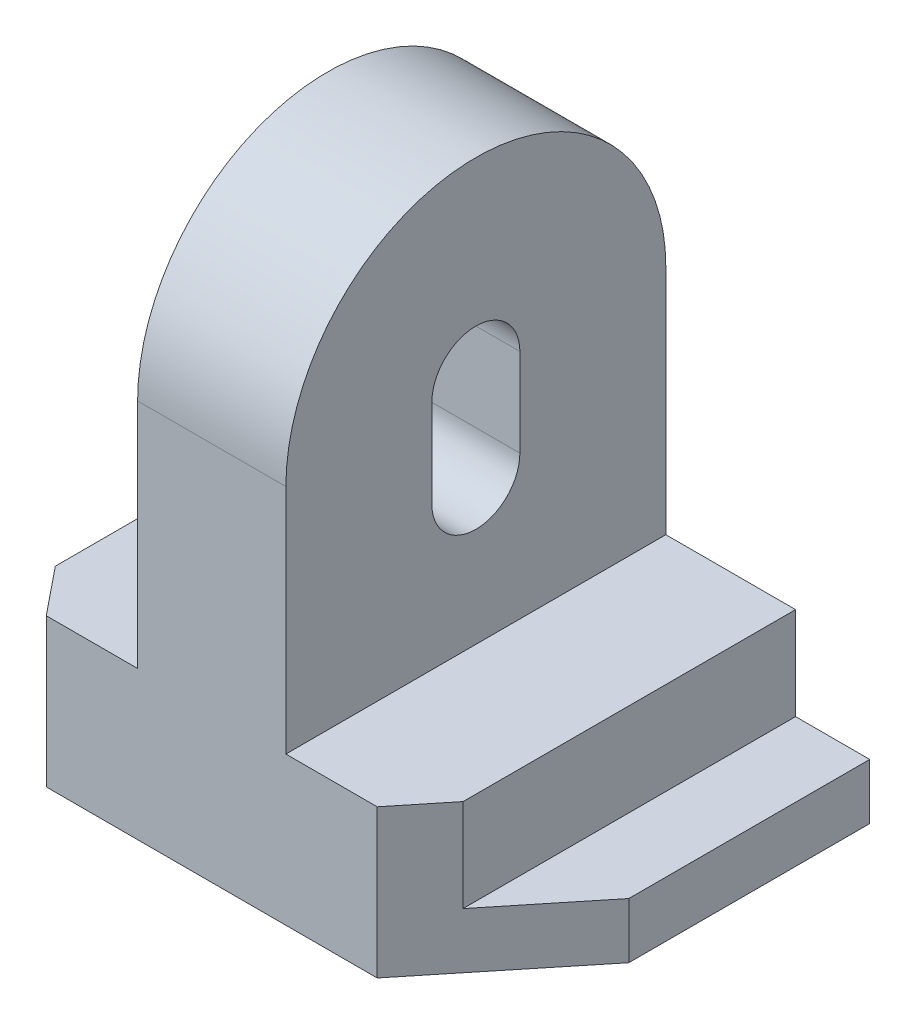
ISO-10303-21;
HEADER;
FILE_DESCRIPTION(('STEP AP214'),'2;1');
FILE_NAME('part.step','',(''),(''),'','','');
FILE_SCHEMA(('AUTOMOTIVE_DESIGN { 1 0 10303 214 1 1 1 1 }'));
ENDSEC;
DATA;
#1=APPLICATION_CONTEXT('core data for automotive mechanical design processes');
#2=APPLICATION_PROTOCOL_DEFINITION('international standard','automotive_design',2000,#1);
#3=PRODUCT_CONTEXT('',#1,'mechanical');
#4=PRODUCT('Part','Part','',(#3));
#5=PRODUCT_RELATED_PRODUCT_CATEGORY('part','',(#4));
#6=PRODUCT_DEFINITION_FORMATION('','',#4);
#7=PRODUCT_DEFINITION_CONTEXT('part definition',#1,'design');
#8=PRODUCT_DEFINITION('design','',#6,#7);
#9=PRODUCT_DEFINITION_SHAPE('','',#8);
#10=(LENGTH_UNIT() NAMED_UNIT(*) SI_UNIT(.MILLI.,.METRE.));
#11=(NAMED_UNIT(*) PLANE_ANGLE_UNIT() SI_UNIT($,.RADIAN.));
#12=(NAMED_UNIT(*) SI_UNIT($,.STERADIAN.) SOLID_ANGLE_UNIT());
#13=UNCERTAINTY_MEASURE_WITH_UNIT(LENGTH_MEASURE(1.E-05),#10,'distance_accuracy_value','');
#14=(GEOMETRIC_REPRESENTATION_CONTEXT(3) GLOBAL_UNCERTAINTY_ASSIGNED_CONTEXT((#13)) GLOBAL_UNIT_ASSIGNED_CONTEXT((#10,
#11,#12)) REPRESENTATION_CONTEXT('',''));
#15=CARTESIAN_POINT('',(0.,0.,0.));
#16=DIRECTION('',(0.,0.,1.));
#17=DIRECTION('',(1.,0.,0.));
#18=AXIS2_PLACEMENT_3D('',#15,#16,#17);
#19=CARTESIAN_POINT('',(16.,32.,82.));
#20=DIRECTION('',(-1.,0.,0.));
#21=DIRECTION('',(0.,0.,1.));
#22=AXIS2_PLACEMENT_3D('',#19,#20,#21);
#23=PLANE('',#22);
#24=CARTESIAN_POINT('',(16.,63.,41.));
#25=DIRECTION('',(1.,0.,0.));
#26=DIRECTION('',(0.,0.,-1.));
#27=AXIS2_PLACEMENT_3D('',#24,#25,#26);
#28=CIRCLE('',#27,9.5);
#29=CARTESIAN_POINT('',(16.,63.,50.5));
#30=VERTEX_POINT('',#29);
#31=CARTESIAN_POINT('',(16.,63.,31.5));
#32=VERTEX_POINT('',#31);
#33=EDGE_CURVE('E238',#30,#32,#28,.T.);
#34=ORIENTED_EDGE('',*,*,#33,.F.);
#35=DIRECTION('',(0.,-1.,0.));
#36=VECTOR('',#35,1.);
#37=CARTESIAN_POINT('',(16.,0.,50.5));
#38=LINE('',#37,#36);
#39=CARTESIAN_POINT('',(16.,82.,50.5));
#40=VERTEX_POINT('',#39);
#41=EDGE_CURVE('E115',#40,#30,#38,.T.);
#42=ORIENTED_EDGE('',*,*,#41,.F.);
#43=CARTESIAN_POINT('',(16.,82.,41.));
#44=DIRECTION('',(1.,0.,0.));
#45=DIRECTION('',(0.,0.,-1.));
#46=AXIS2_PLACEMENT_3D('',#43,#44,#45);
#47=CIRCLE('',#46,9.5);
#48=CARTESIAN_POINT('',(16.,82.,31.5));
#49=VERTEX_POINT('',#48);
#50=EDGE_CURVE('E245',#49,#40,#47,.T.);
#51=ORIENTED_EDGE('',*,*,#50,.F.);
#52=DIRECTION('',(0.,-1.,0.));
#53=VECTOR('',#52,1.);
#54=CARTESIAN_POINT('',(16.,0.,31.5));
#55=LINE('',#54,#53);
#56=EDGE_CURVE('E228',#49,#32,#55,.T.);
#57=ORIENTED_EDGE('',*,*,#56,.T.);
#58=EDGE_LOOP('',(#34,#42,#51,#57));
#59=FACE_BOUND('',#58,.T.);
#60=DIRECTION('',(0.,1.,0.));
#61=VECTOR('',#60,1.);
#62=CARTESIAN_POINT('',(16.,32.,0.));
#63=LINE('',#62,#61);
#64=CARTESIAN_POINT('',(16.,32.,0.));
#65=VERTEX_POINT('',#64);
#66=CARTESIAN_POINT('',(16.,82.,0.));
#67=VERTEX_POINT('',#66);
#68=EDGE_CURVE('E300',#65,#67,#63,.T.);
#69=ORIENTED_EDGE('',*,*,#68,.T.);
#70=CARTESIAN_POINT('',(16.,82.,41.));
#71=DIRECTION('',(1.,0.,0.));
#72=DIRECTION('',(0.,0.,-1.));
#73=AXIS2_PLACEMENT_3D('',#70,#71,#72);
#74=CIRCLE('',#73,41.);
#75=CARTESIAN_POINT('',(16.,82.,82.));
#76=VERTEX_POINT('',#75);
#77=EDGE_CURVE('E255',#67,#76,#74,.T.);
#78=ORIENTED_EDGE('',*,*,#77,.T.);
#79=DIRECTION('',(0.,1.,0.));
#80=VECTOR('',#79,1.);
#81=CARTESIAN_POINT('',(16.,32.,82.));
#82=LINE('',#81,#80);
#83=CARTESIAN_POINT('',(16.,32.,82.));
#84=VERTEX_POINT('',#83);
#85=EDGE_CURVE('E270',#84,#76,#82,.T.);
#86=ORIENTED_EDGE('',*,*,#85,.F.);
#87=DIRECTION('',(0.,0.,-1.));
#88=VECTOR('',#87,1.);
#89=CARTESIAN_POINT('',(16.,32.,82.));
#90=LINE('',#89,#88);
#91=EDGE_CURVE('E344',#84,#65,#90,.T.);
#92=ORIENTED_EDGE('',*,*,#91,.T.);
#93=EDGE_LOOP('',(#69,#78,#86,#92));
#94=FACE_BOUND('',#93,.T.);
#95=ADVANCED_FACE('F99',(#59,#94),#23,.F.);
#96=CARTESIAN_POINT('',(-16.,32.,82.));
#97=DIRECTION('',(1.,0.,0.));
#98=DIRECTION('',(0.,0.,-1.));
#99=AXIS2_PLACEMENT_3D('',#96,#97,#98);
#100=PLANE('',#99);
#101=CARTESIAN_POINT('',(-16.,82.,41.));
#102=DIRECTION('',(1.,0.,0.));
#103=DIRECTION('',(0.,0.,-1.));
#104=AXIS2_PLACEMENT_3D('',#101,#102,#103);
#105=CIRCLE('',#104,9.5);
#106=CARTESIAN_POINT('',(-16.,82.,31.5));
#107=VERTEX_POINT('',#106);
#108=CARTESIAN_POINT('',(-16.,82.,50.5));
#109=VERTEX_POINT('',#108);
#110=EDGE_CURVE('E108',#107,#109,#105,.T.);
#111=ORIENTED_EDGE('',*,*,#110,.T.);
#112=DIRECTION('',(0.,-1.,0.));
#113=VECTOR('',#112,1.);
#114=CARTESIAN_POINT('',(-16.,32.,50.5));
#115=LINE('',#114,#113);
#116=CARTESIAN_POINT('',(-16.,63.,50.5));
#117=VERTEX_POINT('',#116);
#118=EDGE_CURVE('E12',#109,#117,#115,.T.);
#119=ORIENTED_EDGE('',*,*,#118,.T.);
#120=CARTESIAN_POINT('',(-16.,63.,41.));
#121=DIRECTION('',(1.,0.,0.));
#122=DIRECTION('',(0.,0.,-1.));
#123=AXIS2_PLACEMENT_3D('',#120,#121,#122);
#124=CIRCLE('',#123,9.5);
#125=CARTESIAN_POINT('',(-16.,63.,31.5));
#126=VERTEX_POINT('',#125);
#127=EDGE_CURVE('E403',#117,#126,#124,.T.);
#128=ORIENTED_EDGE('',*,*,#127,.T.);
#129=DIRECTION('',(0.,-1.,0.));
#130=VECTOR('',#129,1.);
#131=CARTESIAN_POINT('',(-16.,32.,31.5));
#132=LINE('',#131,#130);
#133=EDGE_CURVE('E231',#107,#126,#132,.T.);
#134=ORIENTED_EDGE('',*,*,#133,.F.);
#135=EDGE_LOOP('',(#111,#119,#128,#134));
#136=FACE_BOUND('',#135,.T.);
#137=CARTESIAN_POINT('',(-16.,82.,41.));
#138=DIRECTION('',(1.,0.,0.));
#139=DIRECTION('',(0.,0.,-1.));
#140=AXIS2_PLACEMENT_3D('',#137,#138,#139);
#141=CIRCLE('',#140,41.);
#142=CARTESIAN_POINT('',(-16.,82.,0.));
#143=VERTEX_POINT('',#142);
#144=CARTESIAN_POINT('',(-16.,82.,82.));
#145=VERTEX_POINT('',#144);
#146=EDGE_CURVE('E263',#143,#145,#141,.T.);
#147=ORIENTED_EDGE('',*,*,#146,.F.);
#148=DIRECTION('',(0.,-1.,0.));
#149=VECTOR('',#148,1.);
#150=CARTESIAN_POINT('',(-16.,32.,0.));
#151=LINE('',#150,#149);
#152=CARTESIAN_POINT('',(-16.,32.,0.));
#153=VERTEX_POINT('',#152);
#154=EDGE_CURVE('E304',#143,#153,#151,.T.);
#155=ORIENTED_EDGE('',*,*,#154,.T.);
#156=DIRECTION('',(0.,0.,-1.));
#157=VECTOR('',#156,1.);
#158=CARTESIAN_POINT('',(-16.,32.,82.));
#159=LINE('',#158,#157);
#160=CARTESIAN_POINT('',(-16.,32.,82.));
#161=VERTEX_POINT('',#160);
#162=EDGE_CURVE('E340',#161,#153,#159,.T.);
#163=ORIENTED_EDGE('',*,*,#162,.F.);
#164=DIRECTION('',(0.,-1.,0.));
#165=VECTOR('',#164,1.);
#166=CARTESIAN_POINT('',(-16.,32.,82.));
#167=LINE('',#166,#165);
#168=EDGE_CURVE('E275',#145,#161,#167,.T.);
#169=ORIENTED_EDGE('',*,*,#168,.F.);
#170=EDGE_LOOP('',(#147,#155,#163,#169));
#171=FACE_BOUND('',#170,.T.);
#172=ADVANCED_FACE('F410',(#136,#171),#100,.F.);
#173=CARTESIAN_POINT('',(60.,0.,82.));
#174=DIRECTION('',(-1.,0.,0.));
#175=DIRECTION('',(0.,0.,1.));
#176=AXIS2_PLACEMENT_3D('',#173,#174,#175);
#177=PLANE('',#176);
#178=DIRECTION('',(0.,0.,-1.));
#179=VECTOR('',#178,1.);
#180=CARTESIAN_POINT('',(60.,12.,82.));
#181=LINE('',#180,#179);
#182=CARTESIAN_POINT('',(60.,12.,51.9999999999999));
#183=VERTEX_POINT('',#182);
#184=CARTESIAN_POINT('',(60.,12.,0.));
#185=VERTEX_POINT('',#184);
#186=EDGE_CURVE('E354',#183,#185,#181,.T.);
#187=ORIENTED_EDGE('',*,*,#186,.F.);
#188=DIRECTION('',(0.,-1.,0.));
#189=VECTOR('',#188,1.);
#190=CARTESIAN_POINT('',(60.,0.,51.9999999999999));
#191=LINE('',#190,#189);
#192=CARTESIAN_POINT('',(60.,0.,51.9999999999999));
#193=VERTEX_POINT('',#192);
#194=EDGE_CURVE('E370',#183,#193,#191,.T.);
#195=ORIENTED_EDGE('',*,*,#194,.T.);
#196=DIRECTION('',(0.,0.,-1.));
#197=VECTOR('',#196,1.);
#198=CARTESIAN_POINT('',(60.,0.,82.));
#199=LINE('',#198,#197);
#200=CARTESIAN_POINT('',(60.,0.,0.));
#201=VERTEX_POINT('',#200);
#202=EDGE_CURVE('E285',#193,#201,#199,.T.);
#203=ORIENTED_EDGE('',*,*,#202,.T.);
#204=DIRECTION('',(0.,1.,0.));
#205=VECTOR('',#204,1.);
#206=CARTESIAN_POINT('',(60.,0.,0.));
#207=LINE('',#206,#205);
#208=EDGE_CURVE('E266',#201,#185,#207,.T.);
#209=ORIENTED_EDGE('',*,*,#208,.T.);
#210=EDGE_LOOP('',(#187,#195,#203,#209));
#211=FACE_BOUND('',#210,.T.);
#212=ADVANCED_FACE('F432',(#211),#177,.F.);
#213=CARTESIAN_POINT('',(60.,12.,82.));
#214=DIRECTION('',(0.,-1.,0.));
#215=DIRECTION('',(0.,0.,-1.));
#216=AXIS2_PLACEMENT_3D('',#213,#214,#215);
#217=PLANE('',#216);
#218=DIRECTION('',(0.,0.,-1.));
#219=VECTOR('',#218,1.);
#220=CARTESIAN_POINT('',(44.,12.,82.));
#221=LINE('',#220,#219);
#222=CARTESIAN_POINT('',(44.,12.,71.7583545045608));
#223=VERTEX_POINT('',#222);
#224=CARTESIAN_POINT('',(44.,12.,0.));
#225=VERTEX_POINT('',#224);
#226=EDGE_CURVE('E351',#223,#225,#221,.T.);
#227=ORIENTED_EDGE('',*,*,#226,.F.);
#228=DIRECTION('',(0.629320391049836,0.,-0.777145961456972));
#229=VECTOR('',#228,1.);
#230=CARTESIAN_POINT('',(35.7064790041497,12.,82.));
#231=LINE('',#230,#229);
#232=EDGE_CURVE('E367',#223,#183,#231,.T.);
#233=ORIENTED_EDGE('',*,*,#232,.T.);
#234=ORIENTED_EDGE('',*,*,#186,.T.);
#235=DIRECTION('',(-1.,0.,0.));
#236=VECTOR('',#235,1.);
#237=CARTESIAN_POINT('',(60.,12.,0.));
#238=LINE('',#237,#236);
#239=EDGE_CURVE('E289',#185,#225,#238,.T.);
#240=ORIENTED_EDGE('',*,*,#239,.T.);
#241=EDGE_LOOP('',(#227,#233,#234,#240));
#242=FACE_BOUND('',#241,.T.);
#243=ADVANCED_FACE('F444',(#242),#217,.F.);
#244=CARTESIAN_POINT('',(44.,12.,82.));
#245=DIRECTION('',(-1.,0.,0.));
#246=DIRECTION('',(0.,0.,1.));
#247=AXIS2_PLACEMENT_3D('',#244,#245,#246);
#248=PLANE('',#247);
#249=DIRECTION('',(0.,0.,-1.));
#250=VECTOR('',#249,1.);
#251=CARTESIAN_POINT('',(44.,32.,82.));
#252=LINE('',#251,#250);
#253=CARTESIAN_POINT('',(44.,32.,71.7583545045608));
#254=VERTEX_POINT('',#253);
#255=CARTESIAN_POINT('',(44.,32.,0.));
#256=VERTEX_POINT('',#255);
#257=EDGE_CURVE('E348',#254,#256,#252,.T.);
#258=ORIENTED_EDGE('',*,*,#257,.F.);
#259=DIRECTION('',(0.,-1.,0.));
#260=VECTOR('',#259,1.);
#261=CARTESIAN_POINT('',(44.,0.,71.7583545045608));
#262=LINE('',#261,#260);
#263=EDGE_CURVE('E364',#254,#223,#262,.T.);
#264=ORIENTED_EDGE('',*,*,#263,.T.);
#265=ORIENTED_EDGE('',*,*,#226,.T.);
#266=DIRECTION('',(0.,1.,0.));
#267=VECTOR('',#266,1.);
#268=CARTESIAN_POINT('',(44.,12.,0.));
#269=LINE('',#268,#267);
#270=EDGE_CURVE('E293',#225,#256,#269,.T.);
#271=ORIENTED_EDGE('',*,*,#270,.T.);
#272=EDGE_LOOP('',(#258,#264,#265,#271));
#273=FACE_BOUND('',#272,.T.);
#274=ADVANCED_FACE('F440',(#273),#248,.F.);
#275=CARTESIAN_POINT('',(44.,32.,82.));
#276=DIRECTION('',(0.,-1.,0.));
#277=DIRECTION('',(1.,0.,0.));
#278=AXIS2_PLACEMENT_3D('',#275,#276,#277);
#279=PLANE('',#278);
#280=DIRECTION('',(-1.,0.,0.));
#281=VECTOR('',#280,1.);
#282=CARTESIAN_POINT('',(44.,32.,82.));
#283=LINE('',#282,#281);
#284=CARTESIAN_POINT('',(35.7064790041497,32.,82.));
#285=VERTEX_POINT('',#284);
#286=EDGE_CURVE('E267',#285,#84,#283,.T.);
#287=ORIENTED_EDGE('',*,*,#286,.F.);
#288=DIRECTION('',(0.629320391049836,0.,-0.777145961456972));
#289=VECTOR('',#288,1.);
#290=CARTESIAN_POINT('',(35.7064790041497,32.,82.));
#291=LINE('',#290,#289);
#292=EDGE_CURVE('E361',#285,#254,#291,.T.);
#293=ORIENTED_EDGE('',*,*,#292,.T.);
#294=ORIENTED_EDGE('',*,*,#257,.T.);
#295=DIRECTION('',(-1.,0.,0.));
#296=VECTOR('',#295,1.);
#297=CARTESIAN_POINT('',(44.,32.,0.));
#298=LINE('',#297,#296);
#299=EDGE_CURVE('E297',#256,#65,#298,.T.);
#300=ORIENTED_EDGE('',*,*,#299,.T.);
#301=ORIENTED_EDGE('',*,*,#91,.F.);
#302=EDGE_LOOP('',(#287,#293,#294,#300,#301));
#303=FACE_BOUND('',#302,.T.);
#304=ADVANCED_FACE('F436',(#303),#279,.F.);
#305=CARTESIAN_POINT('',(-44.,32.,82.));
#306=DIRECTION('',(0.,-1.,0.));
#307=DIRECTION('',(1.,0.,0.));
#308=AXIS2_PLACEMENT_3D('',#305,#306,#307);
#309=PLANE('',#308);
#310=DIRECTION('',(0.,0.,-1.));
#311=VECTOR('',#310,1.);
#312=CARTESIAN_POINT('',(-44.,32.,82.));
#313=LINE('',#312,#311);
#314=CARTESIAN_POINT('',(-44.,32.,71.7583545045608));
#315=VERTEX_POINT('',#314);
#316=CARTESIAN_POINT('',(-44.,32.,0.));
#317=VERTEX_POINT('',#316);
#318=EDGE_CURVE('E337',#315,#317,#313,.T.);
#319=ORIENTED_EDGE('',*,*,#318,.F.);
#320=DIRECTION('',(0.629320391049836,0.,0.777145961456972));
#321=VECTOR('',#320,1.);
#322=CARTESIAN_POINT('',(-35.7064790041497,32.,82.));
#323=LINE('',#322,#321);
#324=CARTESIAN_POINT('',(-35.7064790041497,32.,82.));
#325=VERTEX_POINT('',#324);
#326=EDGE_CURVE('E393',#315,#325,#323,.T.);
#327=ORIENTED_EDGE('',*,*,#326,.T.);
#328=DIRECTION('',(-1.,0.,0.));
#329=VECTOR('',#328,1.);
#330=CARTESIAN_POINT('',(-44.,32.,82.));
#331=LINE('',#330,#329);
#332=EDGE_CURVE('E278',#161,#325,#331,.T.);
#333=ORIENTED_EDGE('',*,*,#332,.F.);
#334=ORIENTED_EDGE('',*,*,#162,.T.);
#335=DIRECTION('',(-1.,0.,0.));
#336=VECTOR('',#335,1.);
#337=CARTESIAN_POINT('',(-44.,32.,0.));
#338=LINE('',#337,#336);
#339=EDGE_CURVE('E307',#153,#317,#338,.T.);
#340=ORIENTED_EDGE('',*,*,#339,.T.);
#341=EDGE_LOOP('',(#319,#327,#333,#334,#340));
#342=FACE_BOUND('',#341,.T.);
#343=ADVANCED_FACE('F439',(#342),#309,.F.);
#344=CARTESIAN_POINT('',(-44.,12.,82.));
#345=DIRECTION('',(1.,0.,0.));
#346=DIRECTION('',(0.,0.,-1.));
#347=AXIS2_PLACEMENT_3D('',#344,#345,#346);
#348=PLANE('',#347);
#349=DIRECTION('',(0.,0.,-1.));
#350=VECTOR('',#349,1.);
#351=CARTESIAN_POINT('',(-44.,12.,82.));
#352=LINE('',#351,#350);
#353=CARTESIAN_POINT('',(-44.,12.,71.7583545045608));
#354=VERTEX_POINT('',#353);
#355=CARTESIAN_POINT('',(-44.,12.,0.));
#356=VERTEX_POINT('',#355);
#357=EDGE_CURVE('E334',#354,#356,#352,.T.);
#358=ORIENTED_EDGE('',*,*,#357,.F.);
#359=DIRECTION('',(0.,1.,0.));
#360=VECTOR('',#359,1.);
#361=CARTESIAN_POINT('',(-44.,0.,71.7583545045608));
#362=LINE('',#361,#360);
#363=EDGE_CURVE('E390',#354,#315,#362,.T.);
#364=ORIENTED_EDGE('',*,*,#363,.T.);
#365=ORIENTED_EDGE('',*,*,#318,.T.);
#366=DIRECTION('',(0.,-1.,0.));
#367=VECTOR('',#366,1.);
#368=CARTESIAN_POINT('',(-44.,12.,0.));
#369=LINE('',#368,#367);
#370=EDGE_CURVE('E311',#317,#356,#369,.T.);
#371=ORIENTED_EDGE('',*,*,#370,.T.);
#372=EDGE_LOOP('',(#358,#364,#365,#371));
#373=FACE_BOUND('',#372,.T.);
#374=ADVANCED_FACE('F510',(#373),#348,.F.);
#375=CARTESIAN_POINT('',(-60.,12.,82.));
#376=DIRECTION('',(0.,-1.,0.));
#377=DIRECTION('',(0.,0.,-1.));
#378=AXIS2_PLACEMENT_3D('',#375,#376,#377);
#379=PLANE('',#378);
#380=DIRECTION('',(0.,0.,-1.));
#381=VECTOR('',#380,1.);
#382=CARTESIAN_POINT('',(-60.,12.,82.));
#383=LINE('',#382,#381);
#384=CARTESIAN_POINT('',(-60.,12.,51.9999999999999));
#385=VERTEX_POINT('',#384);
#386=CARTESIAN_POINT('',(-60.,12.,0.));
#387=VERTEX_POINT('',#386);
#388=EDGE_CURVE('E331',#385,#387,#383,.T.);
#389=ORIENTED_EDGE('',*,*,#388,.F.);
#390=DIRECTION('',(0.629320391049836,0.,0.777145961456972));
#391=VECTOR('',#390,1.);
#392=CARTESIAN_POINT('',(-35.7064790041497,12.,82.));
#393=LINE('',#392,#391);
#394=EDGE_CURVE('E387',#385,#354,#393,.T.);
#395=ORIENTED_EDGE('',*,*,#394,.T.);
#396=ORIENTED_EDGE('',*,*,#357,.T.);
#397=DIRECTION('',(-1.,0.,0.));
#398=VECTOR('',#397,1.);
#399=CARTESIAN_POINT('',(-60.,12.,0.));
#400=LINE('',#399,#398);
#401=EDGE_CURVE('E315',#356,#387,#400,.T.);
#402=ORIENTED_EDGE('',*,*,#401,.T.);
#403=EDGE_LOOP('',(#389,#395,#396,#402));
#404=FACE_BOUND('',#403,.T.);
#405=ADVANCED_FACE('F507',(#404),#379,.F.);
#406=CARTESIAN_POINT('',(-60.,0.,82.));
#407=DIRECTION('',(1.,0.,0.));
#408=DIRECTION('',(0.,0.,-1.));
#409=AXIS2_PLACEMENT_3D('',#406,#407,#408);
#410=PLANE('',#409);
#411=DIRECTION('',(0.,0.,-1.));
#412=VECTOR('',#411,1.);
#413=CARTESIAN_POINT('',(-60.,0.,82.));
#414=LINE('',#413,#412);
#415=CARTESIAN_POINT('',(-60.,0.,51.9999999999999));
#416=VERTEX_POINT('',#415);
#417=CARTESIAN_POINT('',(-60.,0.,0.));
#418=VERTEX_POINT('',#417);
#419=EDGE_CURVE('E328',#416,#418,#414,.T.);
#420=ORIENTED_EDGE('',*,*,#419,.F.);
#421=DIRECTION('',(0.,1.,0.));
#422=VECTOR('',#421,1.);
#423=CARTESIAN_POINT('',(-60.,12.,51.9999999999999));
#424=LINE('',#423,#422);
#425=EDGE_CURVE('E384',#416,#385,#424,.T.);
#426=ORIENTED_EDGE('',*,*,#425,.T.);
#427=ORIENTED_EDGE('',*,*,#388,.T.);
#428=DIRECTION('',(0.,-1.,0.));
#429=VECTOR('',#428,1.);
#430=CARTESIAN_POINT('',(-60.,0.,0.));
#431=LINE('',#430,#429);
#432=EDGE_CURVE('E319',#387,#418,#431,.T.);
#433=ORIENTED_EDGE('',*,*,#432,.T.);
#434=EDGE_LOOP('',(#420,#426,#427,#433));
#435=FACE_BOUND('',#434,.T.);
#436=ADVANCED_FACE('F501',(#435),#410,.F.);
#437=CARTESIAN_POINT('',(-60.,0.,82.));
#438=DIRECTION('',(0.,1.,0.));
#439=DIRECTION('',(0.,0.,1.));
#440=AXIS2_PLACEMENT_3D('',#437,#438,#439);
#441=PLANE('',#440);
#442=DIRECTION('',(1.,0.,0.));
#443=VECTOR('',#442,1.);
#444=CARTESIAN_POINT('',(-60.,0.,82.));
#445=LINE('',#444,#443);
#446=CARTESIAN_POINT('',(-35.7064790041497,0.,82.));
#447=VERTEX_POINT('',#446);
#448=CARTESIAN_POINT('',(35.7064790041497,0.,82.));
#449=VERTEX_POINT('',#448);
#450=EDGE_CURVE('E282',#447,#449,#445,.T.);
#451=ORIENTED_EDGE('',*,*,#450,.F.);
#452=DIRECTION('',(-0.629320391049836,0.,-0.777145961456972));
#453=VECTOR('',#452,1.);
#454=CARTESIAN_POINT('',(-35.7064790041497,0.,82.));
#455=LINE('',#454,#453);
#456=EDGE_CURVE('E381',#447,#416,#455,.T.);
#457=ORIENTED_EDGE('',*,*,#456,.T.);
#458=ORIENTED_EDGE('',*,*,#419,.T.);
#459=DIRECTION('',(1.,0.,0.));
#460=VECTOR('',#459,1.);
#461=CARTESIAN_POINT('',(-60.,0.,0.));
#462=LINE('',#461,#460);
#463=EDGE_CURVE('E271',#418,#201,#462,.T.);
#464=ORIENTED_EDGE('',*,*,#463,.T.);
#465=ORIENTED_EDGE('',*,*,#202,.F.);
#466=DIRECTION('',(-0.629320391049836,0.,0.777145961456972));
#467=VECTOR('',#466,1.);
#468=CARTESIAN_POINT('',(35.7064790041497,0.,82.));
#469=LINE('',#468,#467);
#470=EDGE_CURVE('E373',#193,#449,#469,.T.);
#471=ORIENTED_EDGE('',*,*,#470,.T.);
#472=EDGE_LOOP('',(#451,#457,#458,#464,#465,#471));
#473=FACE_BOUND('',#472,.T.);
#474=ADVANCED_FACE('F470',(#473),#441,.F.);
#475=CARTESIAN_POINT('',(0.,0.,82.));
#476=DIRECTION('',(0.,0.,1.));
#477=DIRECTION('',(1.,0.,0.));
#478=AXIS2_PLACEMENT_3D('',#475,#476,#477);
#479=PLANE('',#478);
#480=DIRECTION('',(1.,0.,0.));
#481=VECTOR('',#480,1.);
#482=CARTESIAN_POINT('',(-66.,82.,82.));
#483=LINE('',#482,#481);
#484=EDGE_CURVE('E396',#145,#76,#483,.T.);
#485=ORIENTED_EDGE('',*,*,#484,.F.);
#486=ORIENTED_EDGE('',*,*,#168,.T.);
#487=ORIENTED_EDGE('',*,*,#332,.T.);
#488=DIRECTION('',(0.,-1.,0.));
#489=VECTOR('',#488,1.);
#490=CARTESIAN_POINT('',(-35.7064790041497,0.,82.));
#491=LINE('',#490,#489);
#492=EDGE_CURVE('E377',#325,#447,#491,.T.);
#493=ORIENTED_EDGE('',*,*,#492,.T.);
#494=ORIENTED_EDGE('',*,*,#450,.T.);
#495=DIRECTION('',(0.,1.,0.));
#496=VECTOR('',#495,1.);
#497=CARTESIAN_POINT('',(35.7064790041497,12.,82.));
#498=LINE('',#497,#496);
#499=EDGE_CURVE('E357',#449,#285,#498,.T.);
#500=ORIENTED_EDGE('',*,*,#499,.T.);
#501=ORIENTED_EDGE('',*,*,#286,.T.);
#502=ORIENTED_EDGE('',*,*,#85,.T.);
#503=EDGE_LOOP('',(#485,#486,#487,#493,#494,#500,#501,#502));
#504=FACE_BOUND('',#503,.T.);
#505=ADVANCED_FACE('F460',(#504),#479,.T.);
#506=CARTESIAN_POINT('',(0.,0.,0.));
#507=DIRECTION('',(0.,0.,1.));
#508=DIRECTION('',(1.,0.,0.));
#509=AXIS2_PLACEMENT_3D('',#506,#507,#508);
#510=PLANE('',#509);
#511=ORIENTED_EDGE('',*,*,#154,.F.);
#512=DIRECTION('',(1.,0.,0.));
#513=VECTOR('',#512,1.);
#514=CARTESIAN_POINT('',(-66.,82.,0.));
#515=LINE('',#514,#513);
#516=EDGE_CURVE('E399',#143,#67,#515,.T.);
#517=ORIENTED_EDGE('',*,*,#516,.T.);
#518=ORIENTED_EDGE('',*,*,#68,.F.);
#519=ORIENTED_EDGE('',*,*,#299,.F.);
#520=ORIENTED_EDGE('',*,*,#270,.F.);
#521=ORIENTED_EDGE('',*,*,#239,.F.);
#522=ORIENTED_EDGE('',*,*,#208,.F.);
#523=ORIENTED_EDGE('',*,*,#463,.F.);
#524=ORIENTED_EDGE('',*,*,#432,.F.);
#525=ORIENTED_EDGE('',*,*,#401,.F.);
#526=ORIENTED_EDGE('',*,*,#370,.F.);
#527=ORIENTED_EDGE('',*,*,#339,.F.);
#528=EDGE_LOOP('',(#511,#517,#518,#519,#520,#521,#522,#523,#524,#525,#526,#527));
#529=FACE_BOUND('',#528,.T.);
#530=ADVANCED_FACE('F453',(#529),#510,.F.);
#531=CARTESIAN_POINT('',(35.7064790041497,0.,82.));
#532=DIRECTION('',(0.777145961456972,0.,0.629320391049836));
#533=DIRECTION('',(0.,-1.,0.));
#534=AXIS2_PLACEMENT_3D('',#531,#532,#533);
#535=PLANE('',#534);
#536=ORIENTED_EDGE('',*,*,#470,.F.);
#537=ORIENTED_EDGE('',*,*,#194,.F.);
#538=ORIENTED_EDGE('',*,*,#232,.F.);
#539=ORIENTED_EDGE('',*,*,#263,.F.);
#540=ORIENTED_EDGE('',*,*,#292,.F.);
#541=ORIENTED_EDGE('',*,*,#499,.F.);
#542=EDGE_LOOP('',(#536,#537,#538,#539,#540,#541));
#543=FACE_BOUND('',#542,.T.);
#544=ADVANCED_FACE('F451',(#543),#535,.T.);
#545=CARTESIAN_POINT('',(-35.7064790041497,0.,82.));
#546=DIRECTION('',(-0.777145961456972,0.,0.629320391049836));
#547=DIRECTION('',(0.,1.,0.));
#548=AXIS2_PLACEMENT_3D('',#545,#546,#547);
#549=PLANE('',#548);
#550=ORIENTED_EDGE('',*,*,#394,.F.);
#551=ORIENTED_EDGE('',*,*,#425,.F.);
#552=ORIENTED_EDGE('',*,*,#456,.F.);
#553=ORIENTED_EDGE('',*,*,#492,.F.);
#554=ORIENTED_EDGE('',*,*,#326,.F.);
#555=ORIENTED_EDGE('',*,*,#363,.F.);
#556=EDGE_LOOP('',(#550,#551,#552,#553,#554,#555));
#557=FACE_BOUND('',#556,.T.);
#558=ADVANCED_FACE('F101',(#557),#549,.T.);
#559=CARTESIAN_POINT('',(-66.,82.,41.));
#560=DIRECTION('',(1.,0.,0.));
#561=DIRECTION('',(0.,0.,-1.));
#562=AXIS2_PLACEMENT_3D('',#559,#560,#561);
#563=CYLINDRICAL_SURFACE('',#562,41.);
#564=ORIENTED_EDGE('',*,*,#146,.T.);
#565=ORIENTED_EDGE('',*,*,#484,.T.);
#566=ORIENTED_EDGE('',*,*,#77,.F.);
#567=ORIENTED_EDGE('',*,*,#516,.F.);
#568=EDGE_LOOP('',(#564,#565,#566,#567));
#569=FACE_BOUND('',#568,.T.);
#570=ADVANCED_FACE('F417',(#569),#563,.T.);
#571=CARTESIAN_POINT('',(-66.,0.,50.5));
#572=DIRECTION('',(0.,0.,1.));
#573=DIRECTION('',(1.,0.,0.));
#574=AXIS2_PLACEMENT_3D('',#571,#572,#573);
#575=PLANE('',#574);
#576=DIRECTION('',(1.,0.,0.));
#577=VECTOR('',#576,1.);
#578=CARTESIAN_POINT('',(-66.,82.,50.5));
#579=LINE('',#578,#577);
#580=EDGE_CURVE('E252',#109,#40,#579,.T.);
#581=ORIENTED_EDGE('',*,*,#580,.T.);
#582=ORIENTED_EDGE('',*,*,#41,.T.);
#583=DIRECTION('',(1.,0.,0.));
#584=VECTOR('',#583,1.);
#585=CARTESIAN_POINT('',(-66.,63.,50.5));
#586=LINE('',#585,#584);
#587=EDGE_CURVE('E235',#117,#30,#586,.T.);
#588=ORIENTED_EDGE('',*,*,#587,.F.);
#589=ORIENTED_EDGE('',*,*,#118,.F.);
#590=EDGE_LOOP('',(#581,#582,#588,#589));
#591=FACE_BOUND('',#590,.T.);
#592=ADVANCED_FACE('F415',(#591),#575,.F.);
#593=CARTESIAN_POINT('',(-66.,82.,41.));
#594=DIRECTION('',(1.,0.,0.));
#595=DIRECTION('',(0.,0.,-1.));
#596=AXIS2_PLACEMENT_3D('',#593,#594,#595);
#597=CYLINDRICAL_SURFACE('',#596,9.5);
#598=DIRECTION('',(1.,0.,0.));
#599=VECTOR('',#598,1.);
#600=CARTESIAN_POINT('',(-66.,82.,31.5));
#601=LINE('',#600,#599);
#602=EDGE_CURVE('E234',#107,#49,#601,.T.);
#603=ORIENTED_EDGE('',*,*,#602,.T.);
#604=ORIENTED_EDGE('',*,*,#50,.T.);
#605=ORIENTED_EDGE('',*,*,#580,.F.);
#606=ORIENTED_EDGE('',*,*,#110,.F.);
#607=EDGE_LOOP('',(#603,#604,#605,#606));
#608=FACE_BOUND('',#607,.T.);
#609=ADVANCED_FACE('F414',(#608),#597,.F.);
#610=CARTESIAN_POINT('',(-66.,0.,31.5));
#611=DIRECTION('',(0.,0.,1.));
#612=DIRECTION('',(1.,0.,0.));
#613=AXIS2_PLACEMENT_3D('',#610,#611,#612);
#614=PLANE('',#613);
#615=ORIENTED_EDGE('',*,*,#133,.T.);
#616=DIRECTION('',(1.,0.,0.));
#617=VECTOR('',#616,1.);
#618=CARTESIAN_POINT('',(-66.,63.,31.5));
#619=LINE('',#618,#617);
#620=EDGE_CURVE('E123',#126,#32,#619,.T.);
#621=ORIENTED_EDGE('',*,*,#620,.T.);
#622=ORIENTED_EDGE('',*,*,#56,.F.);
#623=ORIENTED_EDGE('',*,*,#602,.F.);
#624=EDGE_LOOP('',(#615,#621,#622,#623));
#625=FACE_BOUND('',#624,.T.);
#626=ADVANCED_FACE('F225',(#625),#614,.T.);
#627=CARTESIAN_POINT('',(-66.,63.,41.));
#628=DIRECTION('',(1.,0.,0.));
#629=DIRECTION('',(0.,0.,-1.));
#630=AXIS2_PLACEMENT_3D('',#627,#628,#629);
#631=CYLINDRICAL_SURFACE('',#630,9.5);
#632=ORIENTED_EDGE('',*,*,#587,.T.);
#633=ORIENTED_EDGE('',*,*,#33,.T.);
#634=ORIENTED_EDGE('',*,*,#620,.F.);
#635=ORIENTED_EDGE('',*,*,#127,.F.);
#636=EDGE_LOOP('',(#632,#633,#634,#635));
#637=FACE_BOUND('',#636,.T.);
#638=ADVANCED_FACE('F239',(#637),#631,.F.);
#639=CLOSED_SHELL('',(#95,#172,#212,#243,#274,#304,#343,#374,#405,#436,#474,#505,#530,#544,#558,
#570,#592,#609,#626,#638));
#640=MANIFOLD_SOLID_BREP('B2',#639);
#641=ADVANCED_BREP_SHAPE_REPRESENTATION('',(#18,#640),#14);
#642=SHAPE_DEFINITION_REPRESENTATION(#9,#641);
ENDSEC;
END-ISO-10303-21;
